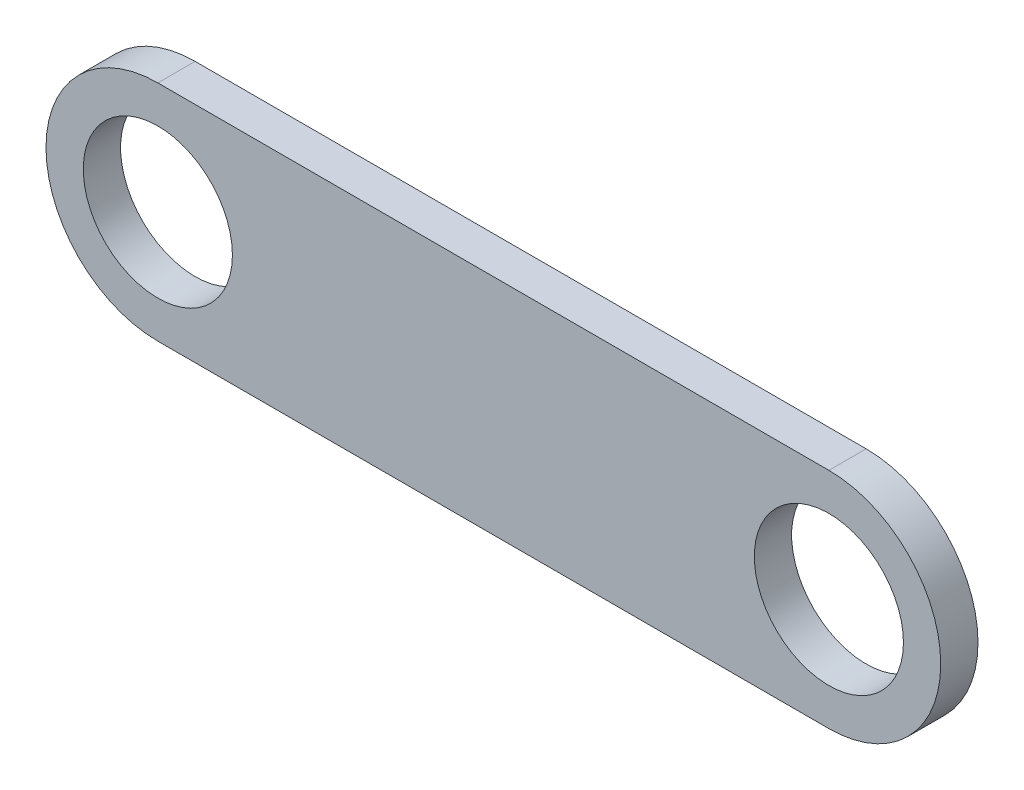
ISO-10303-21;
HEADER;
FILE_DESCRIPTION(('STEP AP214'),'2;1');
FILE_NAME('part.step','',(''),(''),'','','');
FILE_SCHEMA(('AUTOMOTIVE_DESIGN { 1 0 10303 214 1 1 1 1 }'));
ENDSEC;
DATA;
#1=APPLICATION_CONTEXT('core data for automotive mechanical design processes');
#2=APPLICATION_PROTOCOL_DEFINITION('international standard','automotive_design',2000,#1);
#3=PRODUCT_CONTEXT('',#1,'mechanical');
#4=PRODUCT('Part','Part','',(#3));
#5=PRODUCT_RELATED_PRODUCT_CATEGORY('part','',(#4));
#6=PRODUCT_DEFINITION_FORMATION('','',#4);
#7=PRODUCT_DEFINITION_CONTEXT('part definition',#1,'design');
#8=PRODUCT_DEFINITION('design','',#6,#7);
#9=PRODUCT_DEFINITION_SHAPE('','',#8);
#10=(LENGTH_UNIT() NAMED_UNIT(*) SI_UNIT(.MILLI.,.METRE.));
#11=(NAMED_UNIT(*) PLANE_ANGLE_UNIT() SI_UNIT($,.RADIAN.));
#12=(NAMED_UNIT(*) SI_UNIT($,.STERADIAN.) SOLID_ANGLE_UNIT());
#13=UNCERTAINTY_MEASURE_WITH_UNIT(LENGTH_MEASURE(1.E-05),#10,'distance_accuracy_value','');
#14=(GEOMETRIC_REPRESENTATION_CONTEXT(3) GLOBAL_UNCERTAINTY_ASSIGNED_CONTEXT((#13)) GLOBAL_UNIT_ASSIGNED_CONTEXT((#10,
#11,#12)) REPRESENTATION_CONTEXT('',''));
#15=CARTESIAN_POINT('',(0.,0.,0.));
#16=DIRECTION('',(0.,0.,1.));
#17=DIRECTION('',(1.,0.,0.));
#18=AXIS2_PLACEMENT_3D('',#15,#16,#17);
#19=CARTESIAN_POINT('',(-27.041412759607,-2.24598930481283,5.));
#20=DIRECTION('',(0.,0.,1.));
#21=DIRECTION('',(1.,0.,0.));
#22=AXIS2_PLACEMENT_3D('',#19,#20,#21);
#23=PLANE('',#22);
#24=CARTESIAN_POINT('',(-27.041412759607,-2.24598930481283,5.));
#25=DIRECTION('',(0.,0.,1.));
#26=DIRECTION('',(1.,0.,0.));
#27=AXIS2_PLACEMENT_3D('',#24,#25,#26);
#28=CIRCLE('',#27,10.);
#29=CARTESIAN_POINT('',(-17.041412759607,-2.24598930481283,5.));
#30=VERTEX_POINT('',#29);
#31=EDGE_CURVE('E118',#30,#30,#28,.T.);
#32=ORIENTED_EDGE('',*,*,#31,.F.);
#33=EDGE_LOOP('',(#32));
#34=FACE_BOUND('',#33,.T.);
#35=CARTESIAN_POINT('',(-27.041412759607,-2.24598930481283,5.));
#36=DIRECTION('',(0.,0.,1.));
#37=DIRECTION('',(1.,0.,0.));
#38=AXIS2_PLACEMENT_3D('',#35,#36,#37);
#39=CIRCLE('',#38,15.);
#40=CARTESIAN_POINT('',(-27.041412759607,12.7540106951872,5.));
#41=VERTEX_POINT('',#40);
#42=CARTESIAN_POINT('',(-27.041412759607,-17.2459893048128,5.));
#43=VERTEX_POINT('',#42);
#44=EDGE_CURVE('E98',#41,#43,#39,.T.);
#45=ORIENTED_EDGE('',*,*,#44,.T.);
#46=DIRECTION('',(1.,0.,0.));
#47=VECTOR('',#46,1.);
#48=CARTESIAN_POINT('',(-27.041412759607,-17.2459893048128,5.));
#49=LINE('',#48,#47);
#50=CARTESIAN_POINT('',(62.958587240393,-17.2459893048128,5.));
#51=VERTEX_POINT('',#50);
#52=EDGE_CURVE('E93',#43,#51,#49,.T.);
#53=ORIENTED_EDGE('',*,*,#52,.T.);
#54=CARTESIAN_POINT('',(62.958587240393,-2.24598930481283,5.));
#55=DIRECTION('',(0.,0.,1.));
#56=DIRECTION('',(1.,0.,0.));
#57=AXIS2_PLACEMENT_3D('',#54,#55,#56);
#58=CIRCLE('',#57,15.);
#59=CARTESIAN_POINT('',(62.958587240393,12.7540106951872,5.));
#60=VERTEX_POINT('',#59);
#61=EDGE_CURVE('E96',#51,#60,#58,.T.);
#62=ORIENTED_EDGE('',*,*,#61,.T.);
#63=DIRECTION('',(-1.,0.,0.));
#64=VECTOR('',#63,1.);
#65=CARTESIAN_POINT('',(-27.041412759607,12.7540106951872,5.));
#66=LINE('',#65,#64);
#67=EDGE_CURVE('E63',#60,#41,#66,.T.);
#68=ORIENTED_EDGE('',*,*,#67,.T.);
#69=EDGE_LOOP('',(#45,#53,#62,#68));
#70=FACE_BOUND('',#69,.T.);
#71=CARTESIAN_POINT('',(62.958587240393,-2.24598930481283,5.));
#72=DIRECTION('',(0.,0.,1.));
#73=DIRECTION('',(1.,0.,0.));
#74=AXIS2_PLACEMENT_3D('',#71,#72,#73);
#75=CIRCLE('',#74,9.99999999999999);
#76=CARTESIAN_POINT('',(72.958587240393,-2.24598930481283,5.));
#77=VERTEX_POINT('',#76);
#78=EDGE_CURVE('E140',#77,#77,#75,.T.);
#79=ORIENTED_EDGE('',*,*,#78,.F.);
#80=EDGE_LOOP('',(#79));
#81=FACE_BOUND('',#80,.T.);
#82=ADVANCED_FACE('F45',(#34,#70,#81),#23,.T.);
#83=CARTESIAN_POINT('',(-27.041412759607,-2.24598930481283,0.));
#84=DIRECTION('',(0.,0.,1.));
#85=DIRECTION('',(1.,0.,0.));
#86=AXIS2_PLACEMENT_3D('',#83,#84,#85);
#87=PLANE('',#86);
#88=CARTESIAN_POINT('',(-27.041412759607,-2.24598930481283,0.));
#89=DIRECTION('',(0.,0.,1.));
#90=DIRECTION('',(1.,0.,0.));
#91=AXIS2_PLACEMENT_3D('',#88,#89,#90);
#92=CIRCLE('',#91,15.);
#93=CARTESIAN_POINT('',(-27.041412759607,12.7540106951872,0.));
#94=VERTEX_POINT('',#93);
#95=CARTESIAN_POINT('',(-27.041412759607,-17.2459893048128,0.));
#96=VERTEX_POINT('',#95);
#97=EDGE_CURVE('E114',#94,#96,#92,.T.);
#98=ORIENTED_EDGE('',*,*,#97,.F.);
#99=DIRECTION('',(-1.,0.,0.));
#100=VECTOR('',#99,1.);
#101=CARTESIAN_POINT('',(-27.041412759607,12.7540106951872,0.));
#102=LINE('',#101,#100);
#103=CARTESIAN_POINT('',(62.958587240393,12.7540106951872,0.));
#104=VERTEX_POINT('',#103);
#105=EDGE_CURVE('E86',#104,#94,#102,.T.);
#106=ORIENTED_EDGE('',*,*,#105,.F.);
#107=CARTESIAN_POINT('',(62.958587240393,-2.24598930481283,0.));
#108=DIRECTION('',(0.,0.,1.));
#109=DIRECTION('',(1.,0.,0.));
#110=AXIS2_PLACEMENT_3D('',#107,#108,#109);
#111=CIRCLE('',#110,15.);
#112=CARTESIAN_POINT('',(62.958587240393,-17.2459893048128,0.));
#113=VERTEX_POINT('',#112);
#114=EDGE_CURVE('E80',#113,#104,#111,.T.);
#115=ORIENTED_EDGE('',*,*,#114,.F.);
#116=DIRECTION('',(1.,0.,0.));
#117=VECTOR('',#116,1.);
#118=CARTESIAN_POINT('',(-27.041412759607,-17.2459893048128,0.));
#119=LINE('',#118,#117);
#120=EDGE_CURVE('E103',#96,#113,#119,.T.);
#121=ORIENTED_EDGE('',*,*,#120,.F.);
#122=EDGE_LOOP('',(#98,#106,#115,#121));
#123=FACE_BOUND('',#122,.T.);
#124=CARTESIAN_POINT('',(-27.041412759607,-2.24598930481283,0.));
#125=DIRECTION('',(0.,0.,1.));
#126=DIRECTION('',(1.,0.,0.));
#127=AXIS2_PLACEMENT_3D('',#124,#125,#126);
#128=CIRCLE('',#127,10.);
#129=CARTESIAN_POINT('',(-17.041412759607,-2.24598930481283,0.));
#130=VERTEX_POINT('',#129);
#131=EDGE_CURVE('E136',#130,#130,#128,.T.);
#132=ORIENTED_EDGE('',*,*,#131,.T.);
#133=EDGE_LOOP('',(#132));
#134=FACE_BOUND('',#133,.T.);
#135=CARTESIAN_POINT('',(62.958587240393,-2.24598930481283,0.));
#136=DIRECTION('',(0.,0.,1.));
#137=DIRECTION('',(1.,0.,0.));
#138=AXIS2_PLACEMENT_3D('',#135,#136,#137);
#139=CIRCLE('',#138,9.99999999999999);
#140=CARTESIAN_POINT('',(72.958587240393,-2.24598930481283,0.));
#141=VERTEX_POINT('',#140);
#142=EDGE_CURVE('E144',#141,#141,#139,.T.);
#143=ORIENTED_EDGE('',*,*,#142,.T.);
#144=EDGE_LOOP('',(#143));
#145=FACE_BOUND('',#144,.T.);
#146=ADVANCED_FACE('F131',(#123,#134,#145),#87,.F.);
#147=CARTESIAN_POINT('',(-27.041412759607,-2.24598930481283,5.));
#148=DIRECTION('',(0.,0.,-1.));
#149=DIRECTION('',(-1.,0.,0.));
#150=AXIS2_PLACEMENT_3D('',#147,#148,#149);
#151=CYLINDRICAL_SURFACE('',#150,15.);
#152=ORIENTED_EDGE('',*,*,#97,.T.);
#153=DIRECTION('',(0.,0.,-1.));
#154=VECTOR('',#153,1.);
#155=CARTESIAN_POINT('',(-27.041412759607,-17.2459893048128,5.));
#156=LINE('',#155,#154);
#157=EDGE_CURVE('E11',#43,#96,#156,.T.);
#158=ORIENTED_EDGE('',*,*,#157,.F.);
#159=ORIENTED_EDGE('',*,*,#44,.F.);
#160=DIRECTION('',(0.,0.,-1.));
#161=VECTOR('',#160,1.);
#162=CARTESIAN_POINT('',(-27.041412759607,12.7540106951872,5.));
#163=LINE('',#162,#161);
#164=EDGE_CURVE('E110',#41,#94,#163,.T.);
#165=ORIENTED_EDGE('',*,*,#164,.T.);
#166=EDGE_LOOP('',(#152,#158,#159,#165));
#167=FACE_BOUND('',#166,.T.);
#168=ADVANCED_FACE('F47',(#167),#151,.T.);
#169=CARTESIAN_POINT('',(-27.041412759607,-17.2459893048128,5.));
#170=DIRECTION('',(0.,1.,0.));
#171=DIRECTION('',(0.,0.,1.));
#172=AXIS2_PLACEMENT_3D('',#169,#170,#171);
#173=PLANE('',#172);
#174=ORIENTED_EDGE('',*,*,#120,.T.);
#175=DIRECTION('',(0.,0.,-1.));
#176=VECTOR('',#175,1.);
#177=CARTESIAN_POINT('',(62.958587240393,-17.2459893048128,5.));
#178=LINE('',#177,#176);
#179=EDGE_CURVE('E55',#51,#113,#178,.T.);
#180=ORIENTED_EDGE('',*,*,#179,.F.);
#181=ORIENTED_EDGE('',*,*,#52,.F.);
#182=ORIENTED_EDGE('',*,*,#157,.T.);
#183=EDGE_LOOP('',(#174,#180,#181,#182));
#184=FACE_BOUND('',#183,.T.);
#185=ADVANCED_FACE('F102',(#184),#173,.F.);
#186=CARTESIAN_POINT('',(62.958587240393,-2.24598930481283,5.));
#187=DIRECTION('',(0.,0.,-1.));
#188=DIRECTION('',(-1.,0.,0.));
#189=AXIS2_PLACEMENT_3D('',#186,#187,#188);
#190=CYLINDRICAL_SURFACE('',#189,15.);
#191=ORIENTED_EDGE('',*,*,#114,.T.);
#192=DIRECTION('',(0.,0.,-1.));
#193=VECTOR('',#192,1.);
#194=CARTESIAN_POINT('',(62.958587240393,12.7540106951872,5.));
#195=LINE('',#194,#193);
#196=EDGE_CURVE('E105',#60,#104,#195,.T.);
#197=ORIENTED_EDGE('',*,*,#196,.F.);
#198=ORIENTED_EDGE('',*,*,#61,.F.);
#199=ORIENTED_EDGE('',*,*,#179,.T.);
#200=EDGE_LOOP('',(#191,#197,#198,#199));
#201=FACE_BOUND('',#200,.T.);
#202=ADVANCED_FACE('F106',(#201),#190,.T.);
#203=CARTESIAN_POINT('',(-27.041412759607,12.7540106951872,5.));
#204=DIRECTION('',(0.,-1.,0.));
#205=DIRECTION('',(0.,0.,-1.));
#206=AXIS2_PLACEMENT_3D('',#203,#204,#205);
#207=PLANE('',#206);
#208=ORIENTED_EDGE('',*,*,#105,.T.);
#209=ORIENTED_EDGE('',*,*,#164,.F.);
#210=ORIENTED_EDGE('',*,*,#67,.F.);
#211=ORIENTED_EDGE('',*,*,#196,.T.);
#212=EDGE_LOOP('',(#208,#209,#210,#211));
#213=FACE_BOUND('',#212,.T.);
#214=ADVANCED_FACE('F128',(#213),#207,.F.);
#215=CARTESIAN_POINT('',(-27.041412759607,-2.24598930481283,5.));
#216=DIRECTION('',(0.,0.,-1.));
#217=DIRECTION('',(-1.,0.,0.));
#218=AXIS2_PLACEMENT_3D('',#215,#216,#217);
#219=CYLINDRICAL_SURFACE('',#218,10.);
#220=ORIENTED_EDGE('',*,*,#31,.T.);
#221=EDGE_LOOP('',(#220));
#222=FACE_BOUND('',#221,.T.);
#223=ORIENTED_EDGE('',*,*,#131,.F.);
#224=EDGE_LOOP('',(#223));
#225=FACE_BOUND('',#224,.T.);
#226=ADVANCED_FACE('F163',(#222,#225),#219,.F.);
#227=CARTESIAN_POINT('',(62.958587240393,-2.24598930481283,5.));
#228=DIRECTION('',(0.,0.,-1.));
#229=DIRECTION('',(-1.,0.,0.));
#230=AXIS2_PLACEMENT_3D('',#227,#228,#229);
#231=CYLINDRICAL_SURFACE('',#230,9.99999999999999);
#232=ORIENTED_EDGE('',*,*,#78,.T.);
#233=EDGE_LOOP('',(#232));
#234=FACE_BOUND('',#233,.T.);
#235=ORIENTED_EDGE('',*,*,#142,.F.);
#236=EDGE_LOOP('',(#235));
#237=FACE_BOUND('',#236,.T.);
#238=ADVANCED_FACE('F152',(#234,#237),#231,.F.);
#239=CLOSED_SHELL('',(#82,#146,#168,#185,#202,#214,#226,#238));
#240=MANIFOLD_SOLID_BREP('B2',#239);
#241=ADVANCED_BREP_SHAPE_REPRESENTATION('',(#18,#240),#14);
#242=SHAPE_DEFINITION_REPRESENTATION(#9,#241);
ENDSEC;
END-ISO-10303-21;
